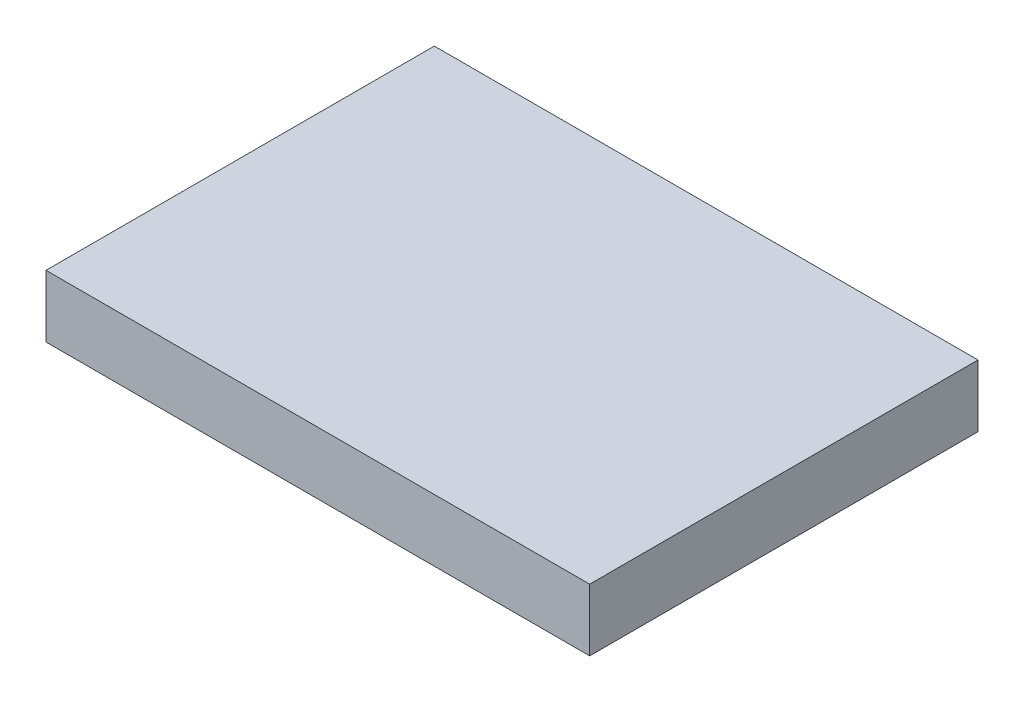
ISO-10303-21;
HEADER;
FILE_DESCRIPTION(('STEP AP214'),'2;1');
FILE_NAME('part.step','',(''),(''),'','','');
FILE_SCHEMA(('AUTOMOTIVE_DESIGN { 1 0 10303 214 1 1 1 1 }'));
ENDSEC;
DATA;
#1=APPLICATION_CONTEXT('core data for automotive mechanical design processes');
#2=APPLICATION_PROTOCOL_DEFINITION('international standard','automotive_design',2000,#1);
#3=PRODUCT_CONTEXT('',#1,'mechanical');
#4=PRODUCT('Part','Part','',(#3));
#5=PRODUCT_RELATED_PRODUCT_CATEGORY('part','',(#4));
#6=PRODUCT_DEFINITION_FORMATION('','',#4);
#7=PRODUCT_DEFINITION_CONTEXT('part definition',#1,'design');
#8=PRODUCT_DEFINITION('design','',#6,#7);
#9=PRODUCT_DEFINITION_SHAPE('','',#8);
#10=(LENGTH_UNIT() NAMED_UNIT(*) SI_UNIT(.MILLI.,.METRE.));
#11=(NAMED_UNIT(*) PLANE_ANGLE_UNIT() SI_UNIT($,.RADIAN.));
#12=(NAMED_UNIT(*) SI_UNIT($,.STERADIAN.) SOLID_ANGLE_UNIT());
#13=UNCERTAINTY_MEASURE_WITH_UNIT(LENGTH_MEASURE(1.E-05),#10,'distance_accuracy_value','');
#14=(GEOMETRIC_REPRESENTATION_CONTEXT(3) GLOBAL_UNCERTAINTY_ASSIGNED_CONTEXT((#13)) GLOBAL_UNIT_ASSIGNED_CONTEXT((#10,
#11,#12)) REPRESENTATION_CONTEXT('',''));
#15=CARTESIAN_POINT('',(0.,0.,0.));
#16=DIRECTION('',(0.,0.,1.));
#17=DIRECTION('',(1.,0.,0.));
#18=AXIS2_PLACEMENT_3D('',#15,#16,#17);
#19=CARTESIAN_POINT('',(8.75,2.,-6.25));
#20=DIRECTION('',(-1.,0.,0.));
#21=DIRECTION('',(0.,0.,1.));
#22=AXIS2_PLACEMENT_3D('',#19,#20,#21);
#23=PLANE('',#22);
#24=DIRECTION('',(0.,0.,-1.));
#25=VECTOR('',#24,1.);
#26=CARTESIAN_POINT('',(8.75,0.,-6.25));
#27=LINE('',#26,#25);
#28=CARTESIAN_POINT('',(8.75,0.,6.25));
#29=VERTEX_POINT('',#28);
#30=CARTESIAN_POINT('',(8.75,0.,-6.25));
#31=VERTEX_POINT('',#30);
#32=EDGE_CURVE('E98',#29,#31,#27,.T.);
#33=ORIENTED_EDGE('',*,*,#32,.T.);
#34=DIRECTION('',(0.,-1.,0.));
#35=VECTOR('',#34,1.);
#36=CARTESIAN_POINT('',(8.75,2.,-6.25));
#37=LINE('',#36,#35);
#38=CARTESIAN_POINT('',(8.75,2.,-6.25));
#39=VERTEX_POINT('',#38);
#40=EDGE_CURVE('E11',#39,#31,#37,.T.);
#41=ORIENTED_EDGE('',*,*,#40,.F.);
#42=DIRECTION('',(0.,0.,-1.));
#43=VECTOR('',#42,1.);
#44=CARTESIAN_POINT('',(8.75,2.,-6.25));
#45=LINE('',#44,#43);
#46=CARTESIAN_POINT('',(8.75,2.,6.25));
#47=VERTEX_POINT('',#46);
#48=EDGE_CURVE('E86',#47,#39,#45,.T.);
#49=ORIENTED_EDGE('',*,*,#48,.F.);
#50=DIRECTION('',(0.,-1.,0.));
#51=VECTOR('',#50,1.);
#52=CARTESIAN_POINT('',(8.75,2.,6.25));
#53=LINE('',#52,#51);
#54=EDGE_CURVE('E94',#47,#29,#53,.T.);
#55=ORIENTED_EDGE('',*,*,#54,.T.);
#56=EDGE_LOOP('',(#33,#41,#49,#55));
#57=FACE_BOUND('',#56,.T.);
#58=ADVANCED_FACE('F35',(#57),#23,.F.);
#59=CARTESIAN_POINT('',(-8.75,2.,-6.25));
#60=DIRECTION('',(0.,0.,1.));
#61=DIRECTION('',(1.,0.,0.));
#62=AXIS2_PLACEMENT_3D('',#59,#60,#61);
#63=PLANE('',#62);
#64=DIRECTION('',(-1.,0.,0.));
#65=VECTOR('',#64,1.);
#66=CARTESIAN_POINT('',(-8.75,0.,-6.25));
#67=LINE('',#66,#65);
#68=CARTESIAN_POINT('',(-8.75,0.,-6.25));
#69=VERTEX_POINT('',#68);
#70=EDGE_CURVE('E90',#31,#69,#67,.T.);
#71=ORIENTED_EDGE('',*,*,#70,.T.);
#72=DIRECTION('',(0.,-1.,0.));
#73=VECTOR('',#72,1.);
#74=CARTESIAN_POINT('',(-8.75,2.,-6.25));
#75=LINE('',#74,#73);
#76=CARTESIAN_POINT('',(-8.75,2.,-6.25));
#77=VERTEX_POINT('',#76);
#78=EDGE_CURVE('E43',#77,#69,#75,.T.);
#79=ORIENTED_EDGE('',*,*,#78,.F.);
#80=DIRECTION('',(-1.,0.,0.));
#81=VECTOR('',#80,1.);
#82=CARTESIAN_POINT('',(-8.75,2.,-6.25));
#83=LINE('',#82,#81);
#84=EDGE_CURVE('E81',#39,#77,#83,.T.);
#85=ORIENTED_EDGE('',*,*,#84,.F.);
#86=ORIENTED_EDGE('',*,*,#40,.T.);
#87=EDGE_LOOP('',(#71,#79,#85,#86));
#88=FACE_BOUND('',#87,.T.);
#89=ADVANCED_FACE('F89',(#88),#63,.F.);
#90=CARTESIAN_POINT('',(-8.75,2.,-6.25));
#91=DIRECTION('',(1.,0.,0.));
#92=DIRECTION('',(0.,0.,-1.));
#93=AXIS2_PLACEMENT_3D('',#90,#91,#92);
#94=PLANE('',#93);
#95=DIRECTION('',(0.,0.,1.));
#96=VECTOR('',#95,1.);
#97=CARTESIAN_POINT('',(-8.75,0.,-6.25));
#98=LINE('',#97,#96);
#99=CARTESIAN_POINT('',(-8.75,0.,6.25));
#100=VERTEX_POINT('',#99);
#101=EDGE_CURVE('E68',#69,#100,#98,.T.);
#102=ORIENTED_EDGE('',*,*,#101,.T.);
#103=DIRECTION('',(0.,-1.,0.));
#104=VECTOR('',#103,1.);
#105=CARTESIAN_POINT('',(-8.75,2.,6.25));
#106=LINE('',#105,#104);
#107=CARTESIAN_POINT('',(-8.75,2.,6.25));
#108=VERTEX_POINT('',#107);
#109=EDGE_CURVE('E91',#108,#100,#106,.T.);
#110=ORIENTED_EDGE('',*,*,#109,.F.);
#111=DIRECTION('',(0.,0.,1.));
#112=VECTOR('',#111,1.);
#113=CARTESIAN_POINT('',(-8.75,2.,-6.25));
#114=LINE('',#113,#112);
#115=EDGE_CURVE('E84',#77,#108,#114,.T.);
#116=ORIENTED_EDGE('',*,*,#115,.F.);
#117=ORIENTED_EDGE('',*,*,#78,.T.);
#118=EDGE_LOOP('',(#102,#110,#116,#117));
#119=FACE_BOUND('',#118,.T.);
#120=ADVANCED_FACE('F92',(#119),#94,.F.);
#121=CARTESIAN_POINT('',(-8.75,2.,6.25));
#122=DIRECTION('',(0.,0.,-1.));
#123=DIRECTION('',(-1.,0.,0.));
#124=AXIS2_PLACEMENT_3D('',#121,#122,#123);
#125=PLANE('',#124);
#126=DIRECTION('',(1.,0.,0.));
#127=VECTOR('',#126,1.);
#128=CARTESIAN_POINT('',(-8.75,0.,6.25));
#129=LINE('',#128,#127);
#130=EDGE_CURVE('E74',#100,#29,#129,.T.);
#131=ORIENTED_EDGE('',*,*,#130,.T.);
#132=ORIENTED_EDGE('',*,*,#54,.F.);
#133=DIRECTION('',(1.,0.,0.));
#134=VECTOR('',#133,1.);
#135=CARTESIAN_POINT('',(-8.75,2.,6.25));
#136=LINE('',#135,#134);
#137=EDGE_CURVE('E51',#108,#47,#136,.T.);
#138=ORIENTED_EDGE('',*,*,#137,.F.);
#139=ORIENTED_EDGE('',*,*,#109,.T.);
#140=EDGE_LOOP('',(#131,#132,#138,#139));
#141=FACE_BOUND('',#140,.T.);
#142=ADVANCED_FACE('F105',(#141),#125,.F.);
#143=CARTESIAN_POINT('',(0.,2.,0.));
#144=DIRECTION('',(0.,1.,0.));
#145=DIRECTION('',(0.,0.,1.));
#146=AXIS2_PLACEMENT_3D('',#143,#144,#145);
#147=PLANE('',#146);
#148=ORIENTED_EDGE('',*,*,#48,.T.);
#149=ORIENTED_EDGE('',*,*,#84,.T.);
#150=ORIENTED_EDGE('',*,*,#115,.T.);
#151=ORIENTED_EDGE('',*,*,#137,.T.);
#152=EDGE_LOOP('',(#148,#149,#150,#151));
#153=FACE_BOUND('',#152,.T.);
#154=ADVANCED_FACE('F82',(#153),#147,.T.);
#155=CARTESIAN_POINT('',(0.,0.,0.));
#156=DIRECTION('',(0.,1.,0.));
#157=DIRECTION('',(0.,0.,1.));
#158=AXIS2_PLACEMENT_3D('',#155,#156,#157);
#159=PLANE('',#158);
#160=ORIENTED_EDGE('',*,*,#32,.F.);
#161=ORIENTED_EDGE('',*,*,#130,.F.);
#162=ORIENTED_EDGE('',*,*,#101,.F.);
#163=ORIENTED_EDGE('',*,*,#70,.F.);
#164=EDGE_LOOP('',(#160,#161,#162,#163));
#165=FACE_BOUND('',#164,.T.);
#166=ADVANCED_FACE('F108',(#165),#159,.F.);
#167=CLOSED_SHELL('',(#58,#89,#120,#142,#154,#166));
#168=MANIFOLD_SOLID_BREP('B2',#167);
#169=ADVANCED_BREP_SHAPE_REPRESENTATION('',(#18,#168),#14);
#170=SHAPE_DEFINITION_REPRESENTATION(#9,#169);
ENDSEC;
END-ISO-10303-21;
